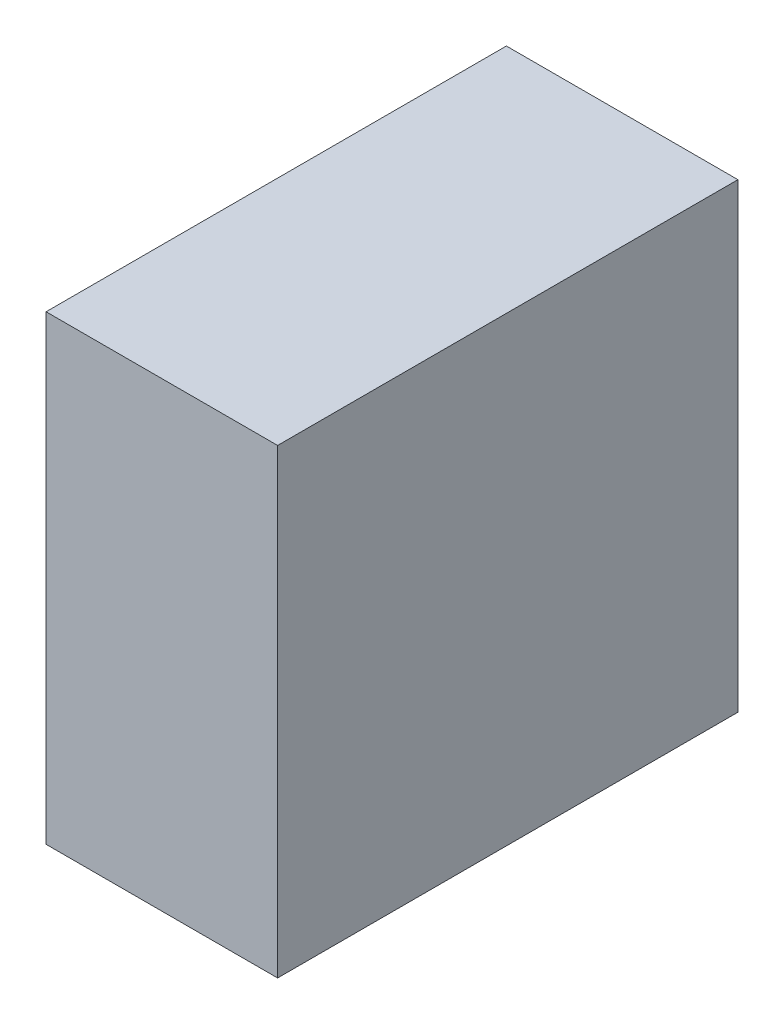
ISO-10303-21;
HEADER;
FILE_DESCRIPTION(('STEP AP214'),'2;1');
FILE_NAME('part.step','',(''),(''),'','','');
FILE_SCHEMA(('AUTOMOTIVE_DESIGN { 1 0 10303 214 1 1 1 1 }'));
ENDSEC;
DATA;
#1=APPLICATION_CONTEXT('core data for automotive mechanical design processes');
#2=APPLICATION_PROTOCOL_DEFINITION('international standard','automotive_design',2000,#1);
#3=PRODUCT_CONTEXT('',#1,'mechanical');
#4=PRODUCT('Part','Part','',(#3));
#5=PRODUCT_RELATED_PRODUCT_CATEGORY('part','',(#4));
#6=PRODUCT_DEFINITION_FORMATION('','',#4);
#7=PRODUCT_DEFINITION_CONTEXT('part definition',#1,'design');
#8=PRODUCT_DEFINITION('design','',#6,#7);
#9=PRODUCT_DEFINITION_SHAPE('','',#8);
#10=(LENGTH_UNIT() NAMED_UNIT(*) SI_UNIT(.MILLI.,.METRE.));
#11=(NAMED_UNIT(*) PLANE_ANGLE_UNIT() SI_UNIT($,.RADIAN.));
#12=(NAMED_UNIT(*) SI_UNIT($,.STERADIAN.) SOLID_ANGLE_UNIT());
#13=UNCERTAINTY_MEASURE_WITH_UNIT(LENGTH_MEASURE(1.E-05),#10,'distance_accuracy_value','');
#14=(GEOMETRIC_REPRESENTATION_CONTEXT(3) GLOBAL_UNCERTAINTY_ASSIGNED_CONTEXT((#13)) GLOBAL_UNIT_ASSIGNED_CONTEXT((#10,
#11,#12)) REPRESENTATION_CONTEXT('',''));
#15=CARTESIAN_POINT('',(0.,0.,0.));
#16=DIRECTION('',(0.,0.,1.));
#17=DIRECTION('',(1.,0.,0.));
#18=AXIS2_PLACEMENT_3D('',#15,#16,#17);
#19=CARTESIAN_POINT('',(0.,0.,0.));
#20=DIRECTION('',(0.,0.,-1.));
#21=DIRECTION('',(-1.,0.,0.));
#22=AXIS2_PLACEMENT_3D('',#19,#20,#21);
#23=PLANE('',#22);
#24=DIRECTION('',(0.,-1.,0.));
#25=VECTOR('',#24,1.);
#26=CARTESIAN_POINT('',(-2.,-2.,0.));
#27=LINE('',#26,#25);
#28=CARTESIAN_POINT('',(-2.,1002.,0.));
#29=VERTEX_POINT('',#28);
#30=CARTESIAN_POINT('',(-2.,-2.,0.));
#31=VERTEX_POINT('',#30);
#32=EDGE_CURVE('E112',#29,#31,#27,.T.);
#33=ORIENTED_EDGE('',*,*,#32,.F.);
#34=DIRECTION('',(-1.,0.,0.));
#35=VECTOR('',#34,1.);
#36=CARTESIAN_POINT('',(-2.,1002.,0.));
#37=LINE('',#36,#35);
#38=CARTESIAN_POINT('',(502.,1002.,0.));
#39=VERTEX_POINT('',#38);
#40=EDGE_CURVE('E63',#39,#29,#37,.T.);
#41=ORIENTED_EDGE('',*,*,#40,.F.);
#42=DIRECTION('',(0.,1.,0.));
#43=VECTOR('',#42,1.);
#44=CARTESIAN_POINT('',(502.,-2.,0.));
#45=LINE('',#44,#43);
#46=CARTESIAN_POINT('',(502.,-2.,0.));
#47=VERTEX_POINT('',#46);
#48=EDGE_CURVE('E182',#47,#39,#45,.T.);
#49=ORIENTED_EDGE('',*,*,#48,.F.);
#50=DIRECTION('',(1.,0.,0.));
#51=VECTOR('',#50,1.);
#52=CARTESIAN_POINT('',(-2.,-2.,0.));
#53=LINE('',#52,#51);
#54=EDGE_CURVE('E179',#31,#47,#53,.T.);
#55=ORIENTED_EDGE('',*,*,#54,.F.);
#56=EDGE_LOOP('',(#33,#41,#49,#55));
#57=FACE_BOUND('',#56,.T.);
#58=DIRECTION('',(-1.,0.,0.));
#59=VECTOR('',#58,1.);
#60=CARTESIAN_POINT('',(0.,1000.,0.));
#61=LINE('',#60,#59);
#62=CARTESIAN_POINT('',(500.,1000.,0.));
#63=VERTEX_POINT('',#62);
#64=CARTESIAN_POINT('',(0.,1000.,0.));
#65=VERTEX_POINT('',#64);
#66=EDGE_CURVE('E140',#63,#65,#61,.T.);
#67=ORIENTED_EDGE('',*,*,#66,.T.);
#68=DIRECTION('',(0.,-1.,0.));
#69=VECTOR('',#68,1.);
#70=CARTESIAN_POINT('',(0.,0.,0.));
#71=LINE('',#70,#69);
#72=CARTESIAN_POINT('',(0.,0.,0.));
#73=VERTEX_POINT('',#72);
#74=EDGE_CURVE('E55',#65,#73,#71,.T.);
#75=ORIENTED_EDGE('',*,*,#74,.T.);
#76=DIRECTION('',(1.,0.,0.));
#77=VECTOR('',#76,1.);
#78=CARTESIAN_POINT('',(0.,0.,0.));
#79=LINE('',#78,#77);
#80=CARTESIAN_POINT('',(500.,0.,0.));
#81=VERTEX_POINT('',#80);
#82=EDGE_CURVE('E155',#73,#81,#79,.T.);
#83=ORIENTED_EDGE('',*,*,#82,.T.);
#84=DIRECTION('',(0.,1.,0.));
#85=VECTOR('',#84,1.);
#86=CARTESIAN_POINT('',(500.,0.,0.));
#87=LINE('',#86,#85);
#88=EDGE_CURVE('E159',#81,#63,#87,.T.);
#89=ORIENTED_EDGE('',*,*,#88,.T.);
#90=EDGE_LOOP('',(#67,#75,#83,#89));
#91=FACE_BOUND('',#90,.T.);
#92=ADVANCED_FACE('F39',(#57,#91),#23,.T.);
#93=CARTESIAN_POINT('',(-2.,-2.,1000.));
#94=DIRECTION('',(1.,0.,0.));
#95=DIRECTION('',(0.,0.,-1.));
#96=AXIS2_PLACEMENT_3D('',#93,#94,#95);
#97=PLANE('',#96);
#98=ORIENTED_EDGE('',*,*,#32,.T.);
#99=DIRECTION('',(0.,0.,-1.));
#100=VECTOR('',#99,1.);
#101=CARTESIAN_POINT('',(-2.,-2.,1000.));
#102=LINE('',#101,#100);
#103=CARTESIAN_POINT('',(-2.,-2.,1002.));
#104=VERTEX_POINT('',#103);
#105=EDGE_CURVE('E11',#104,#31,#102,.T.);
#106=ORIENTED_EDGE('',*,*,#105,.F.);
#107=DIRECTION('',(0.,-1.,0.));
#108=VECTOR('',#107,1.);
#109=CARTESIAN_POINT('',(-2.,1002.,1002.));
#110=LINE('',#109,#108);
#111=CARTESIAN_POINT('',(-2.,1002.,1002.));
#112=VERTEX_POINT('',#111);
#113=EDGE_CURVE('E110',#112,#104,#110,.T.);
#114=ORIENTED_EDGE('',*,*,#113,.F.);
#115=DIRECTION('',(0.,0.,-1.));
#116=VECTOR('',#115,1.);
#117=CARTESIAN_POINT('',(-2.,1002.,1000.));
#118=LINE('',#117,#116);
#119=EDGE_CURVE('E187',#112,#29,#118,.T.);
#120=ORIENTED_EDGE('',*,*,#119,.T.);
#121=EDGE_LOOP('',(#98,#106,#114,#120));
#122=FACE_BOUND('',#121,.T.);
#123=ADVANCED_FACE('F41',(#122),#97,.F.);
#124=CARTESIAN_POINT('',(-2.,-2.,1000.));
#125=DIRECTION('',(0.,1.,0.));
#126=DIRECTION('',(0.,0.,1.));
#127=AXIS2_PLACEMENT_3D('',#124,#125,#126);
#128=PLANE('',#127);
#129=ORIENTED_EDGE('',*,*,#54,.T.);
#130=DIRECTION('',(0.,0.,-1.));
#131=VECTOR('',#130,1.);
#132=CARTESIAN_POINT('',(502.,-2.,1000.));
#133=LINE('',#132,#131);
#134=CARTESIAN_POINT('',(502.,-2.,1002.));
#135=VERTEX_POINT('',#134);
#136=EDGE_CURVE('E48',#135,#47,#133,.T.);
#137=ORIENTED_EDGE('',*,*,#136,.F.);
#138=DIRECTION('',(1.,0.,0.));
#139=VECTOR('',#138,1.);
#140=CARTESIAN_POINT('',(-2.,-2.,1002.));
#141=LINE('',#140,#139);
#142=EDGE_CURVE('E115',#104,#135,#141,.T.);
#143=ORIENTED_EDGE('',*,*,#142,.F.);
#144=ORIENTED_EDGE('',*,*,#105,.T.);
#145=EDGE_LOOP('',(#129,#137,#143,#144));
#146=FACE_BOUND('',#145,.T.);
#147=ADVANCED_FACE('F116',(#146),#128,.F.);
#148=CARTESIAN_POINT('',(502.,-2.,1000.));
#149=DIRECTION('',(-1.,0.,0.));
#150=DIRECTION('',(0.,0.,1.));
#151=AXIS2_PLACEMENT_3D('',#148,#149,#150);
#152=PLANE('',#151);
#153=ORIENTED_EDGE('',*,*,#48,.T.);
#154=DIRECTION('',(0.,0.,-1.));
#155=VECTOR('',#154,1.);
#156=CARTESIAN_POINT('',(502.,1002.,1000.));
#157=LINE('',#156,#155);
#158=CARTESIAN_POINT('',(502.,1002.,1002.));
#159=VERTEX_POINT('',#158);
#160=EDGE_CURVE('E190',#159,#39,#157,.T.);
#161=ORIENTED_EDGE('',*,*,#160,.F.);
#162=DIRECTION('',(0.,1.,0.));
#163=VECTOR('',#162,1.);
#164=CARTESIAN_POINT('',(502.,1002.,1002.));
#165=LINE('',#164,#163);
#166=EDGE_CURVE('E122',#135,#159,#165,.T.);
#167=ORIENTED_EDGE('',*,*,#166,.F.);
#168=ORIENTED_EDGE('',*,*,#136,.T.);
#169=EDGE_LOOP('',(#153,#161,#167,#168));
#170=FACE_BOUND('',#169,.T.);
#171=ADVANCED_FACE('F195',(#170),#152,.F.);
#172=CARTESIAN_POINT('',(-2.,1002.,1000.));
#173=DIRECTION('',(0.,-1.,0.));
#174=DIRECTION('',(0.,0.,-1.));
#175=AXIS2_PLACEMENT_3D('',#172,#173,#174);
#176=PLANE('',#175);
#177=ORIENTED_EDGE('',*,*,#40,.T.);
#178=ORIENTED_EDGE('',*,*,#119,.F.);
#179=DIRECTION('',(-1.,0.,0.));
#180=VECTOR('',#179,1.);
#181=CARTESIAN_POINT('',(-2.,1002.,1002.));
#182=LINE('',#181,#180);
#183=EDGE_CURVE('E127',#159,#112,#182,.T.);
#184=ORIENTED_EDGE('',*,*,#183,.F.);
#185=ORIENTED_EDGE('',*,*,#160,.T.);
#186=EDGE_LOOP('',(#177,#178,#184,#185));
#187=FACE_BOUND('',#186,.T.);
#188=ADVANCED_FACE('F228',(#187),#176,.F.);
#189=CARTESIAN_POINT('',(0.,0.,1000.));
#190=DIRECTION('',(1.,0.,0.));
#191=DIRECTION('',(0.,0.,-1.));
#192=AXIS2_PLACEMENT_3D('',#189,#190,#191);
#193=PLANE('',#192);
#194=ORIENTED_EDGE('',*,*,#74,.F.);
#195=DIRECTION('',(0.,0.,-1.));
#196=VECTOR('',#195,1.);
#197=CARTESIAN_POINT('',(0.,1000.,1000.));
#198=LINE('',#197,#196);
#199=CARTESIAN_POINT('',(0.,1000.,1000.));
#200=VERTEX_POINT('',#199);
#201=EDGE_CURVE('E152',#200,#65,#198,.T.);
#202=ORIENTED_EDGE('',*,*,#201,.F.);
#203=DIRECTION('',(0.,-1.,0.));
#204=VECTOR('',#203,1.);
#205=CARTESIAN_POINT('',(0.,0.,1000.));
#206=LINE('',#205,#204);
#207=CARTESIAN_POINT('',(0.,0.,1000.));
#208=VERTEX_POINT('',#207);
#209=EDGE_CURVE('E135',#200,#208,#206,.T.);
#210=ORIENTED_EDGE('',*,*,#209,.T.);
#211=DIRECTION('',(0.,0.,-1.));
#212=VECTOR('',#211,1.);
#213=CARTESIAN_POINT('',(0.,0.,1000.));
#214=LINE('',#213,#212);
#215=EDGE_CURVE('E174',#208,#73,#214,.T.);
#216=ORIENTED_EDGE('',*,*,#215,.T.);
#217=EDGE_LOOP('',(#194,#202,#210,#216));
#218=FACE_BOUND('',#217,.T.);
#219=ADVANCED_FACE('F205',(#218),#193,.T.);
#220=CARTESIAN_POINT('',(0.,0.,1000.));
#221=DIRECTION('',(0.,1.,0.));
#222=DIRECTION('',(0.,0.,1.));
#223=AXIS2_PLACEMENT_3D('',#220,#221,#222);
#224=PLANE('',#223);
#225=ORIENTED_EDGE('',*,*,#82,.F.);
#226=ORIENTED_EDGE('',*,*,#215,.F.);
#227=DIRECTION('',(1.,0.,0.));
#228=VECTOR('',#227,1.);
#229=CARTESIAN_POINT('',(0.,0.,1000.));
#230=LINE('',#229,#228);
#231=CARTESIAN_POINT('',(500.,0.,1000.));
#232=VERTEX_POINT('',#231);
#233=EDGE_CURVE('E139',#208,#232,#230,.T.);
#234=ORIENTED_EDGE('',*,*,#233,.T.);
#235=DIRECTION('',(0.,0.,-1.));
#236=VECTOR('',#235,1.);
#237=CARTESIAN_POINT('',(500.,0.,1000.));
#238=LINE('',#237,#236);
#239=EDGE_CURVE('E171',#232,#81,#238,.T.);
#240=ORIENTED_EDGE('',*,*,#239,.T.);
#241=EDGE_LOOP('',(#225,#226,#234,#240));
#242=FACE_BOUND('',#241,.T.);
#243=ADVANCED_FACE('F209',(#242),#224,.T.);
#244=CARTESIAN_POINT('',(500.,0.,1000.));
#245=DIRECTION('',(-1.,0.,0.));
#246=DIRECTION('',(0.,0.,1.));
#247=AXIS2_PLACEMENT_3D('',#244,#245,#246);
#248=PLANE('',#247);
#249=ORIENTED_EDGE('',*,*,#88,.F.);
#250=ORIENTED_EDGE('',*,*,#239,.F.);
#251=DIRECTION('',(0.,1.,0.));
#252=VECTOR('',#251,1.);
#253=CARTESIAN_POINT('',(500.,0.,1000.));
#254=LINE('',#253,#252);
#255=CARTESIAN_POINT('',(500.,1000.,1000.));
#256=VERTEX_POINT('',#255);
#257=EDGE_CURVE('E144',#232,#256,#254,.T.);
#258=ORIENTED_EDGE('',*,*,#257,.T.);
#259=DIRECTION('',(0.,0.,-1.));
#260=VECTOR('',#259,1.);
#261=CARTESIAN_POINT('',(500.,1000.,1000.));
#262=LINE('',#261,#260);
#263=EDGE_CURVE('E168',#256,#63,#262,.T.);
#264=ORIENTED_EDGE('',*,*,#263,.T.);
#265=EDGE_LOOP('',(#249,#250,#258,#264));
#266=FACE_BOUND('',#265,.T.);
#267=ADVANCED_FACE('F212',(#266),#248,.T.);
#268=CARTESIAN_POINT('',(0.,1000.,1000.));
#269=DIRECTION('',(0.,-1.,0.));
#270=DIRECTION('',(0.,0.,-1.));
#271=AXIS2_PLACEMENT_3D('',#268,#269,#270);
#272=PLANE('',#271);
#273=ORIENTED_EDGE('',*,*,#66,.F.);
#274=ORIENTED_EDGE('',*,*,#263,.F.);
#275=DIRECTION('',(-1.,0.,0.));
#276=VECTOR('',#275,1.);
#277=CARTESIAN_POINT('',(0.,1000.,1000.));
#278=LINE('',#277,#276);
#279=EDGE_CURVE('E148',#256,#200,#278,.T.);
#280=ORIENTED_EDGE('',*,*,#279,.T.);
#281=ORIENTED_EDGE('',*,*,#201,.T.);
#282=EDGE_LOOP('',(#273,#274,#280,#281));
#283=FACE_BOUND('',#282,.T.);
#284=ADVANCED_FACE('F204',(#283),#272,.T.);
#285=CARTESIAN_POINT('',(0.,0.,1000.));
#286=DIRECTION('',(0.,0.,1.));
#287=DIRECTION('',(1.,0.,0.));
#288=AXIS2_PLACEMENT_3D('',#285,#286,#287);
#289=PLANE('',#288);
#290=ORIENTED_EDGE('',*,*,#209,.F.);
#291=ORIENTED_EDGE('',*,*,#279,.F.);
#292=ORIENTED_EDGE('',*,*,#257,.F.);
#293=ORIENTED_EDGE('',*,*,#233,.F.);
#294=EDGE_LOOP('',(#290,#291,#292,#293));
#295=FACE_BOUND('',#294,.T.);
#296=ADVANCED_FACE('F213',(#295),#289,.F.);
#297=CARTESIAN_POINT('',(0.,0.,1002.));
#298=DIRECTION('',(0.,0.,1.));
#299=DIRECTION('',(1.,0.,0.));
#300=AXIS2_PLACEMENT_3D('',#297,#298,#299);
#301=PLANE('',#300);
#302=ORIENTED_EDGE('',*,*,#113,.T.);
#303=ORIENTED_EDGE('',*,*,#142,.T.);
#304=ORIENTED_EDGE('',*,*,#166,.T.);
#305=ORIENTED_EDGE('',*,*,#183,.T.);
#306=EDGE_LOOP('',(#302,#303,#304,#305));
#307=FACE_BOUND('',#306,.T.);
#308=ADVANCED_FACE('F125',(#307),#301,.T.);
#309=CLOSED_SHELL('',(#92,#123,#147,#171,#188,#219,#243,#267,#284,#296,#308));
#310=MANIFOLD_SOLID_BREP('B2',#309);
#311=ADVANCED_BREP_SHAPE_REPRESENTATION('',(#18,#310),#14);
#312=SHAPE_DEFINITION_REPRESENTATION(#9,#311);
ENDSEC;
END-ISO-10303-21;
